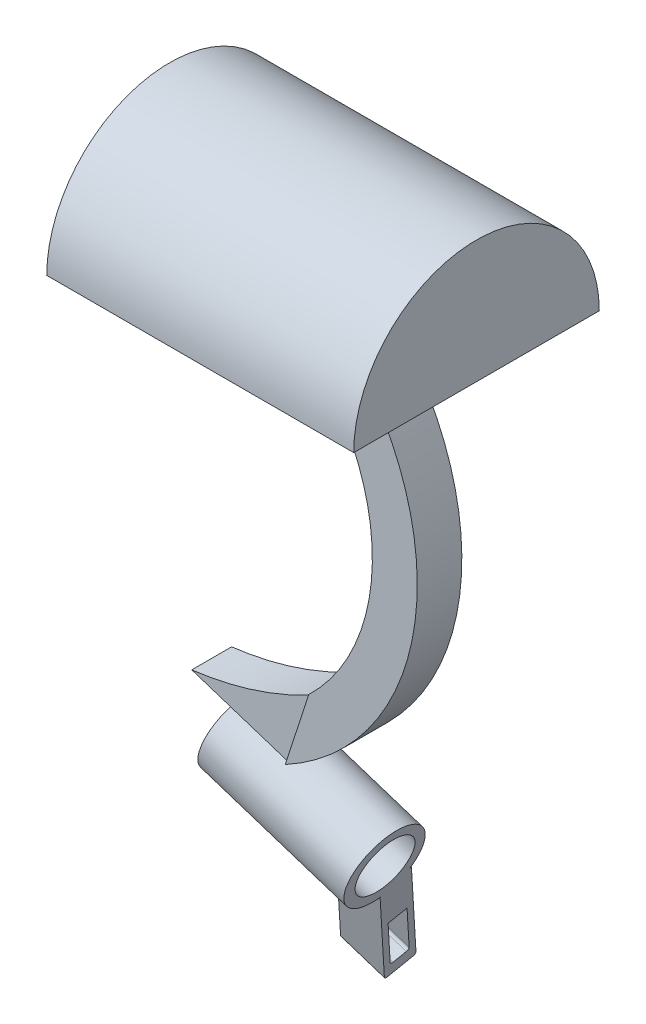
ISO-10303-21;
HEADER;
FILE_DESCRIPTION(('STEP AP214'),'2;1');
FILE_NAME('part.step','',(''),(''),'','','');
FILE_SCHEMA(('AUTOMOTIVE_DESIGN { 1 0 10303 214 1 1 1 1 }'));
ENDSEC;
DATA;
#1=APPLICATION_CONTEXT('core data for automotive mechanical design processes');
#2=APPLICATION_PROTOCOL_DEFINITION('international standard','automotive_design',2000,#1);
#3=PRODUCT_CONTEXT('',#1,'mechanical');
#4=PRODUCT('Part','Part','',(#3));
#5=PRODUCT_RELATED_PRODUCT_CATEGORY('part','',(#4));
#6=PRODUCT_DEFINITION_FORMATION('','',#4);
#7=PRODUCT_DEFINITION_CONTEXT('part definition',#1,'design');
#8=PRODUCT_DEFINITION('design','',#6,#7);
#9=PRODUCT_DEFINITION_SHAPE('','',#8);
#10=(LENGTH_UNIT() NAMED_UNIT(*) SI_UNIT(.MILLI.,.METRE.));
#11=(NAMED_UNIT(*) PLANE_ANGLE_UNIT() SI_UNIT($,.RADIAN.));
#12=(NAMED_UNIT(*) SI_UNIT($,.STERADIAN.) SOLID_ANGLE_UNIT());
#13=UNCERTAINTY_MEASURE_WITH_UNIT(LENGTH_MEASURE(1.E-05),#10,'distance_accuracy_value','');
#14=(GEOMETRIC_REPRESENTATION_CONTEXT(3) GLOBAL_UNCERTAINTY_ASSIGNED_CONTEXT((#13)) GLOBAL_UNIT_ASSIGNED_CONTEXT((#10,
#11,#12)) REPRESENTATION_CONTEXT('',''));
#15=CARTESIAN_POINT('',(0.,0.,0.));
#16=DIRECTION('',(0.,0.,1.));
#17=DIRECTION('',(1.,0.,0.));
#18=AXIS2_PLACEMENT_3D('',#15,#16,#17);
#19=CARTESIAN_POINT('',(8.4794198870601,-26.1055079561511,-2.00859754063387));
#20=DIRECTION('',(0.,0.,1.));
#21=DIRECTION('',(1.,0.,0.));
#22=AXIS2_PLACEMENT_3D('',#19,#20,#21);
#23=PLANE('',#22);
#24=CARTESIAN_POINT('',(3.49552899788866,-30.7707203906488,-2.00859754063387));
#25=CARTESIAN_POINT('',(8.6836530969002,-30.1293735054419,-2.00859754063387));
#26=CARTESIAN_POINT('',(13.3117496174866,-27.6723485276312,-2.00859754063387));
#27=B_SPLINE_CURVE_WITH_KNOTS('',2,(#24,#25,#26),.UNSPECIFIED.,.F.,.F.,(3,3),(0.,1.),.UNSPECIFIED.);
#28=CARTESIAN_POINT('',(13.3117496174866,-27.6723485276312,-2.00859754063387));
#29=VERTEX_POINT('',#28);
#30=CARTESIAN_POINT('',(3.49552899788866,-30.7707203906488,-2.00859754063387));
#31=VERTEX_POINT('',#30);
#32=EDGE_CURVE('E480',#29,#31,#27,.F.);
#33=ORIENTED_EDGE('',*,*,#32,.F.);
#34=DIRECTION('',(-0.308433183362237,-0.951246009926474,0.));
#35=VECTOR('',#34,1.);
#36=CARTESIAN_POINT('',(13.3117496174866,-27.6723485276312,-2.00859754063387));
#37=LINE('',#36,#35);
#38=CARTESIAN_POINT('',(11.4688730530924,-33.3560073335911,-2.00859754063387));
#39=VERTEX_POINT('',#38);
#40=EDGE_CURVE('E503',#29,#39,#37,.T.);
#41=ORIENTED_EDGE('',*,*,#40,.T.);
#42=DIRECTION('',(0.951246009926474,-0.308433183362237,0.));
#43=VECTOR('',#42,1.);
#44=CARTESIAN_POINT('',(6.63654332266587,-31.7891667621109,-2.00859754063387));
#45=LINE('',#44,#43);
#46=EDGE_CURVE('E423',#31,#39,#45,.T.);
#47=ORIENTED_EDGE('',*,*,#46,.F.);
#48=EDGE_LOOP('',(#33,#41,#47));
#49=FACE_BOUND('',#48,.T.);
#50=ADVANCED_FACE('F34',(#49),#23,.F.);
#51=CARTESIAN_POINT('',(8.4794198870601,-26.1055079561511,1.28638790770808));
#52=DIRECTION('',(0.,0.,-1.));
#53=DIRECTION('',(-1.,0.,0.));
#54=AXIS2_PLACEMENT_3D('',#51,#52,#53);
#55=PLANE('',#54);
#56=CARTESIAN_POINT('',(3.49552899788866,-30.7707203906488,1.28638790770808));
#57=CARTESIAN_POINT('',(8.6836530969002,-30.1293735054419,1.28638790770808));
#58=CARTESIAN_POINT('',(13.3117496174866,-27.6723485276312,1.28638790770808));
#59=B_SPLINE_CURVE_WITH_KNOTS('',2,(#56,#57,#58),.UNSPECIFIED.,.F.,.F.,(3,3),(0.,1.),.UNSPECIFIED.);
#60=CARTESIAN_POINT('',(3.49552899788866,-30.7707203906488,1.28638790770808));
#61=VERTEX_POINT('',#60);
#62=CARTESIAN_POINT('',(13.3117496174866,-27.6723485276312,1.28638790770808));
#63=VERTEX_POINT('',#62);
#64=EDGE_CURVE('E323',#61,#63,#59,.T.);
#65=ORIENTED_EDGE('',*,*,#64,.F.);
#66=DIRECTION('',(0.951246009926474,-0.308433183362237,0.));
#67=VECTOR('',#66,1.);
#68=CARTESIAN_POINT('',(6.63654332266587,-31.7891667621109,1.28638790770808));
#69=LINE('',#68,#67);
#70=CARTESIAN_POINT('',(11.4688730530924,-33.3560073335911,1.28638790770808));
#71=VERTEX_POINT('',#70);
#72=EDGE_CURVE('E414',#61,#71,#69,.T.);
#73=ORIENTED_EDGE('',*,*,#72,.T.);
#74=DIRECTION('',(0.308433183362237,0.951246009926474,0.));
#75=VECTOR('',#74,1.);
#76=CARTESIAN_POINT('',(13.3117496174866,-27.6723485276312,1.28638790770808));
#77=LINE('',#76,#75);
#78=EDGE_CURVE('E428',#71,#63,#77,.T.);
#79=ORIENTED_EDGE('',*,*,#78,.T.);
#80=EDGE_LOOP('',(#65,#73,#79));
#81=FACE_BOUND('',#80,.T.);
#82=ADVANCED_FACE('F398',(#81),#55,.F.);
#83=CARTESIAN_POINT('',(15.3320112562343,-4.97127030206573,0.));
#84=DIRECTION('',(0.951246009926474,-0.308433183362237,0.));
#85=DIRECTION('',(0.308433183362237,0.951246009926474,0.));
#86=AXIS2_PLACEMENT_3D('',#83,#84,#85);
#87=PLANE('',#86);
#88=CARTESIAN_POINT('',(5.73148782399525,-34.5804696384339,-0.391699089779879));
#89=DIRECTION('',(0.951246009926474,-0.308433183362237,0.));
#90=DIRECTION('',(0.308433183362237,0.951246009926474,0.));
#91=AXIS2_PLACEMENT_3D('',#88,#89,#90);
#92=CIRCLE('',#91,2.375);
#93=CARTESIAN_POINT('',(6.46401663448056,-32.3212603648585,-0.391699089779879));
#94=VERTEX_POINT('',#93);
#95=EDGE_CURVE('E235',#94,#94,#92,.T.);
#96=ORIENTED_EDGE('',*,*,#95,.T.);
#97=EDGE_LOOP('',(#96));
#98=FACE_BOUND('',#97,.T.);
#99=DIRECTION('',(0.,0.,1.));
#100=VECTOR('',#99,1.);
#101=CARTESIAN_POINT('',(6.63654332266588,-31.789166762111,1.28638790770808));
#102=LINE('',#101,#100);
#103=CARTESIAN_POINT('',(6.63654332266588,-31.7891667621109,-1.60844734182558));
#104=VERTEX_POINT('',#103);
#105=CARTESIAN_POINT('',(6.63654332266588,-31.7891667621109,0.88623770889979));
#106=VERTEX_POINT('',#105);
#107=EDGE_CURVE('E42',#104,#106,#102,.T.);
#108=ORIENTED_EDGE('',*,*,#107,.F.);
#109=CARTESIAN_POINT('',(5.72093113748741,-34.6130277627224,-0.361104816462897));
#110=DIRECTION('',(-0.951246009926474,0.308433183362237,0.));
#111=DIRECTION('',(-0.308433183362237,-0.951246009926474,0.));
#112=AXIS2_PLACEMENT_3D('',#109,#110,#111);
#113=CIRCLE('',#112,3.22000000000001);
#114=EDGE_CURVE('E483',#104,#106,#113,.T.);
#115=ORIENTED_EDGE('',*,*,#114,.T.);
#116=EDGE_LOOP('',(#108,#115));
#117=FACE_BOUND('',#116,.T.);
#118=ADVANCED_FACE('F347',(#98,#117),#87,.F.);
#119=CARTESIAN_POINT('',(16.3097017874055,-18.4262939737782,0.));
#120=DIRECTION('',(0.951246009926474,-0.308433183362237,0.));
#121=DIRECTION('',(0.,0.,1.));
#122=AXIS2_PLACEMENT_3D('',#119,#120,#121);
#123=PLANE('',#122);
#124=ORIENTED_EDGE('',*,*,#40,.F.);
#125=DIRECTION('',(0.,0.,-1.));
#126=VECTOR('',#125,1.);
#127=CARTESIAN_POINT('',(13.3117496174866,-27.6723485276312,1.28638790770808));
#128=LINE('',#127,#126);
#129=EDGE_CURVE('E424',#63,#29,#128,.T.);
#130=ORIENTED_EDGE('',*,*,#129,.F.);
#131=ORIENTED_EDGE('',*,*,#78,.F.);
#132=DIRECTION('',(0.,0.,1.));
#133=VECTOR('',#132,1.);
#134=CARTESIAN_POINT('',(11.4688730530924,-33.3560073335911,1.28638790770808));
#135=LINE('',#134,#133);
#136=CARTESIAN_POINT('',(11.4688730530924,-33.3560073335911,0.88623770889979));
#137=VERTEX_POINT('',#136);
#138=EDGE_CURVE('E419',#137,#71,#135,.T.);
#139=ORIENTED_EDGE('',*,*,#138,.F.);
#140=CARTESIAN_POINT('',(10.5532608679139,-36.1798683342026,-0.361104816462897));
#141=DIRECTION('',(0.951246009926474,-0.308433183362237,0.));
#142=DIRECTION('',(0.308433183362237,0.951246009926474,0.));
#143=AXIS2_PLACEMENT_3D('',#140,#141,#142);
#144=CIRCLE('',#143,3.22000000000001);
#145=CARTESIAN_POINT('',(11.4225779785249,-33.4987870581379,1.19597287984337));
#146=VERTEX_POINT('',#145);
#147=EDGE_CURVE('E360',#137,#146,#144,.T.);
#148=ORIENTED_EDGE('',*,*,#147,.T.);
#149=DIRECTION('',(0.,0.,-1.));
#150=VECTOR('',#149,1.);
#151=CARTESIAN_POINT('',(11.4225779785249,-33.4987870581379,-2.21601123595506));
#152=LINE('',#151,#150);
#153=CARTESIAN_POINT('',(11.4225779785249,-33.4987870581379,1.47398876404494));
#154=VERTEX_POINT('',#153);
#155=EDGE_CURVE('E452',#154,#146,#152,.T.);
#156=ORIENTED_EDGE('',*,*,#155,.F.);
#157=DIRECTION('',(-0.308433183362237,-0.951246009926473,0.));
#158=VECTOR('',#157,1.);
#159=CARTESIAN_POINT('',(13.3626227388853,-27.5154495415509,1.47398876404494));
#160=LINE('',#159,#158);
#161=CARTESIAN_POINT('',(13.3626227388853,-27.5154495415509,1.47398876404494));
#162=VERTEX_POINT('',#161);
#163=EDGE_CURVE('E440',#162,#154,#160,.T.);
#164=ORIENTED_EDGE('',*,*,#163,.F.);
#165=DIRECTION('',(0.,0.,1.));
#166=VECTOR('',#165,1.);
#167=CARTESIAN_POINT('',(13.3626227388853,-27.5154495415509,-2.21601123595506));
#168=LINE('',#167,#166);
#169=CARTESIAN_POINT('',(13.3626227388853,-27.5154495415509,-2.21601123595506));
#170=VERTEX_POINT('',#169);
#171=EDGE_CURVE('E434',#170,#162,#168,.T.);
#172=ORIENTED_EDGE('',*,*,#171,.F.);
#173=DIRECTION('',(0.308433183362237,0.951246009926473,0.));
#174=VECTOR('',#173,1.);
#175=CARTESIAN_POINT('',(13.3626227388853,-27.5154495415509,-2.21601123595506));
#176=LINE('',#175,#174);
#177=CARTESIAN_POINT('',(11.4225779785249,-33.4987870581379,-2.21601123595506));
#178=VERTEX_POINT('',#177);
#179=EDGE_CURVE('E458',#178,#170,#176,.T.);
#180=ORIENTED_EDGE('',*,*,#179,.F.);
#181=CARTESIAN_POINT('',(11.4225779785249,-33.4987870581379,-1.91818251276916));
#182=VERTEX_POINT('',#181);
#183=EDGE_CURVE('E450',#182,#178,#152,.T.);
#184=ORIENTED_EDGE('',*,*,#183,.F.);
#185=CARTESIAN_POINT('',(11.4688730530924,-33.3560073335911,-1.60844734182558));
#186=VERTEX_POINT('',#185);
#187=EDGE_CURVE('E359',#182,#186,#144,.T.);
#188=ORIENTED_EDGE('',*,*,#187,.T.);
#189=EDGE_CURVE('E506',#39,#186,#135,.T.);
#190=ORIENTED_EDGE('',*,*,#189,.F.);
#191=EDGE_LOOP('',(#124,#130,#131,#139,#148,#156,#164,#172,#180,#184,#188,#190));
#192=FACE_BOUND('',#191,.T.);
#193=ADVANCED_FACE('F377',(#192),#123,.F.);
#194=CARTESIAN_POINT('',(0.,0.,-0.742022471910108));
#195=DIRECTION('',(0.,1.,0.));
#196=DIRECTION('',(0.,0.,1.));
#197=AXIS2_PLACEMENT_3D('',#194,#195,#196);
#198=PLANE('',#197);
#199=DIRECTION('',(0.,0.,-1.));
#200=VECTOR('',#199,1.);
#201=CARTESIAN_POINT('',(0.,0.,-0.371011235955054));
#202=LINE('',#201,#200);
#203=CARTESIAN_POINT('',(0.,0.,9.78898876404495));
#204=VERTEX_POINT('',#203);
#205=CARTESIAN_POINT('',(0.,0.,-10.5310112359551));
#206=VERTEX_POINT('',#205);
#207=EDGE_CURVE('E464',#204,#206,#202,.T.);
#208=ORIENTED_EDGE('',*,*,#207,.T.);
#209=DIRECTION('',(-1.,0.,0.));
#210=VECTOR('',#209,1.);
#211=CARTESIAN_POINT('',(0.,0.,-10.5310112359551));
#212=LINE('',#211,#210);
#213=CARTESIAN_POINT('',(25.4,0.,-10.5310112359551));
#214=VERTEX_POINT('',#213);
#215=EDGE_CURVE('E461',#214,#206,#212,.T.);
#216=ORIENTED_EDGE('',*,*,#215,.F.);
#217=DIRECTION('',(0.,0.,1.));
#218=VECTOR('',#217,1.);
#219=CARTESIAN_POINT('',(25.4,0.,-0.371011235955054));
#220=LINE('',#219,#218);
#221=CARTESIAN_POINT('',(25.4,0.,9.78898876404495));
#222=VERTEX_POINT('',#221);
#223=EDGE_CURVE('E466',#214,#222,#220,.T.);
#224=ORIENTED_EDGE('',*,*,#223,.T.);
#225=DIRECTION('',(-1.,0.,0.));
#226=VECTOR('',#225,1.);
#227=CARTESIAN_POINT('',(0.,0.,9.78898876404495));
#228=LINE('',#227,#226);
#229=EDGE_CURVE('E469',#222,#204,#228,.T.);
#230=ORIENTED_EDGE('',*,*,#229,.T.);
#231=EDGE_LOOP('',(#208,#216,#224,#230));
#232=FACE_BOUND('',#231,.T.);
#233=DIRECTION('',(0.,0.,1.));
#234=VECTOR('',#233,1.);
#235=CARTESIAN_POINT('',(9.55499994,0.,-2.21601123595506));
#236=LINE('',#235,#234);
#237=CARTESIAN_POINT('',(9.55499994,0.,-2.21601123595506));
#238=VERTEX_POINT('',#237);
#239=CARTESIAN_POINT('',(9.55499994,0.,1.47398876404494));
#240=VERTEX_POINT('',#239);
#241=EDGE_CURVE('E426',#238,#240,#236,.T.);
#242=ORIENTED_EDGE('',*,*,#241,.T.);
#243=DIRECTION('',(1.,0.,0.));
#244=VECTOR('',#243,1.);
#245=CARTESIAN_POINT('',(9.55499994,0.,1.47398876404494));
#246=LINE('',#245,#244);
#247=CARTESIAN_POINT('',(15.84500006,0.,1.47398876404494));
#248=VERTEX_POINT('',#247);
#249=EDGE_CURVE('E433',#240,#248,#246,.T.);
#250=ORIENTED_EDGE('',*,*,#249,.T.);
#251=DIRECTION('',(0.,0.,-1.));
#252=VECTOR('',#251,1.);
#253=CARTESIAN_POINT('',(15.84500006,0.,-2.21601123595506));
#254=LINE('',#253,#252);
#255=CARTESIAN_POINT('',(15.84500006,0.,-2.21601123595506));
#256=VERTEX_POINT('',#255);
#257=EDGE_CURVE('E445',#248,#256,#254,.T.);
#258=ORIENTED_EDGE('',*,*,#257,.T.);
#259=DIRECTION('',(-1.,0.,0.));
#260=VECTOR('',#259,1.);
#261=CARTESIAN_POINT('',(9.55499994,0.,-2.21601123595506));
#262=LINE('',#261,#260);
#263=EDGE_CURVE('E443',#256,#238,#262,.T.);
#264=ORIENTED_EDGE('',*,*,#263,.T.);
#265=EDGE_LOOP('',(#242,#250,#258,#264));
#266=FACE_BOUND('',#265,.T.);
#267=ADVANCED_FACE('F380',(#232,#266),#198,.F.);
#268=CARTESIAN_POINT('',(0.,0.,-0.371011235955054));
#269=DIRECTION('',(1.,0.,0.));
#270=DIRECTION('',(0.,0.,-1.));
#271=AXIS2_PLACEMENT_3D('',#268,#269,#270);
#272=PLANE('',#271);
#273=CARTESIAN_POINT('',(0.,0.,-0.371011235955054));
#274=DIRECTION('',(-1.,0.,0.));
#275=DIRECTION('',(0.,0.,1.));
#276=AXIS2_PLACEMENT_3D('',#273,#274,#275);
#277=CIRCLE('',#276,10.16);
#278=EDGE_CURVE('E475',#204,#206,#277,.T.);
#279=ORIENTED_EDGE('',*,*,#278,.T.);
#280=ORIENTED_EDGE('',*,*,#207,.F.);
#281=EDGE_LOOP('',(#279,#280));
#282=FACE_BOUND('',#281,.T.);
#283=ADVANCED_FACE('F384',(#282),#272,.F.);
#284=CARTESIAN_POINT('',(0.,0.,-0.371011235955054));
#285=DIRECTION('',(-1.,0.,0.));
#286=DIRECTION('',(0.,0.,1.));
#287=AXIS2_PLACEMENT_3D('',#284,#285,#286);
#288=CYLINDRICAL_SURFACE('',#287,10.16);
#289=CARTESIAN_POINT('',(25.4,0.,-0.371011235955054));
#290=DIRECTION('',(-1.,0.,0.));
#291=DIRECTION('',(0.,0.,1.));
#292=AXIS2_PLACEMENT_3D('',#289,#290,#291);
#293=CIRCLE('',#292,10.16);
#294=EDGE_CURVE('E472',#222,#214,#293,.T.);
#295=ORIENTED_EDGE('',*,*,#294,.T.);
#296=ORIENTED_EDGE('',*,*,#215,.T.);
#297=ORIENTED_EDGE('',*,*,#278,.F.);
#298=ORIENTED_EDGE('',*,*,#229,.F.);
#299=EDGE_LOOP('',(#295,#296,#297,#298));
#300=FACE_BOUND('',#299,.T.);
#301=ADVANCED_FACE('F36',(#300),#288,.T.);
#302=CARTESIAN_POINT('',(25.4,0.,-0.371011235955054));
#303=DIRECTION('',(-1.,0.,0.));
#304=DIRECTION('',(0.,0.,1.));
#305=AXIS2_PLACEMENT_3D('',#302,#303,#304);
#306=PLANE('',#305);
#307=ORIENTED_EDGE('',*,*,#223,.F.);
#308=ORIENTED_EDGE('',*,*,#294,.F.);
#309=EDGE_LOOP('',(#307,#308));
#310=FACE_BOUND('',#309,.T.);
#311=ADVANCED_FACE('F376',(#310),#306,.F.);
#312=CARTESIAN_POINT('',(1.45678681096229,-15.1418176082245,0.));
#313=DIRECTION('',(0.,0.,-1.));
#314=DIRECTION('',(-1.,0.,0.));
#315=AXIS2_PLACEMENT_3D('',#312,#313,#314);
#316=CYLINDRICAL_SURFACE('',#315,17.1713626822118);
#317=CARTESIAN_POINT('',(1.45678681096229,-15.1418176082245,1.47398876404494));
#318=DIRECTION('',(0.,0.,-1.));
#319=DIRECTION('',(0.471611559251894,0.881806405726335,0.));
#320=AXIS2_PLACEMENT_3D('',#317,#318,#319);
#321=CIRCLE('',#320,17.1713626822118);
#322=EDGE_CURVE('E436',#240,#162,#321,.T.);
#323=ORIENTED_EDGE('',*,*,#322,.F.);
#324=ORIENTED_EDGE('',*,*,#241,.F.);
#325=CARTESIAN_POINT('',(1.45678681096229,-15.1418176082245,-2.21601123595506));
#326=DIRECTION('',(0.,0.,-1.));
#327=DIRECTION('',(0.471611559251894,0.881806405726335,0.));
#328=AXIS2_PLACEMENT_3D('',#325,#326,#327);
#329=CIRCLE('',#328,17.1713626822118);
#330=EDGE_CURVE('E437',#238,#170,#329,.T.);
#331=ORIENTED_EDGE('',*,*,#330,.T.);
#332=ORIENTED_EDGE('',*,*,#171,.T.);
#333=EDGE_LOOP('',(#323,#324,#331,#332));
#334=FACE_BOUND('',#333,.T.);
#335=ADVANCED_FACE('F389',(#334),#316,.F.);
#336=CARTESIAN_POINT('',(9.55499994,0.,1.47398876404494));
#337=DIRECTION('',(0.,0.,-1.));
#338=DIRECTION('',(-1.,0.,0.));
#339=AXIS2_PLACEMENT_3D('',#336,#337,#338);
#340=PLANE('',#339);
#341=CARTESIAN_POINT('',(1.45678681096229,-15.1418176082245,1.47398876404494));
#342=DIRECTION('',(0.,0.,-1.));
#343=DIRECTION('',(0.688837192778454,0.724916079174065,0.));
#344=AXIS2_PLACEMENT_3D('',#341,#342,#343);
#345=CIRCLE('',#344,20.8876834756878);
#346=EDGE_CURVE('E447',#248,#154,#345,.T.);
#347=ORIENTED_EDGE('',*,*,#346,.F.);
#348=ORIENTED_EDGE('',*,*,#249,.F.);
#349=ORIENTED_EDGE('',*,*,#322,.T.);
#350=ORIENTED_EDGE('',*,*,#163,.T.);
#351=EDGE_LOOP('',(#347,#348,#349,#350));
#352=FACE_BOUND('',#351,.T.);
#353=ADVANCED_FACE('F370',(#352),#340,.F.);
#354=CARTESIAN_POINT('',(1.45678681096229,-15.1418176082245,0.));
#355=DIRECTION('',(0.,0.,-1.));
#356=DIRECTION('',(-1.,0.,0.));
#357=AXIS2_PLACEMENT_3D('',#354,#355,#356);
#358=CYLINDRICAL_SURFACE('',#357,20.8876834756878);
#359=ORIENTED_EDGE('',*,*,#155,.T.);
#360=CARTESIAN_POINT('',(11.4225779785249,-33.4987870581379,1.19597287984337));
#361=CARTESIAN_POINT('',(11.4610881963903,-33.4778805321114,1.13848649285918));
#362=CARTESIAN_POINT('',(11.4976974271193,-33.457848595571,1.07938677636928));
#363=CARTESIAN_POINT('',(11.5667879864595,-33.4198030430014,0.958147248746149));
#364=CARTESIAN_POINT('',(11.5992665209433,-33.4017907941144,0.896005418774431));
#365=CARTESIAN_POINT('',(11.6598364071952,-33.3680160660679,0.768695207691123));
#366=CARTESIAN_POINT('',(11.6879099190608,-33.3522627564843,0.703515839204143));
#367=CARTESIAN_POINT('',(11.7391724176084,-33.3233666913531,0.570739597193408));
#368=CARTESIAN_POINT('',(11.7623624604645,-33.3102233713641,0.503143250109748));
#369=CARTESIAN_POINT('',(11.8243143230406,-33.2749918398734,0.29669962430612));
#370=CARTESIAN_POINT('',(11.8552549856085,-33.2572162665025,0.154619691802103));
#371=CARTESIAN_POINT('',(11.8943387194357,-33.2347267107852,-0.133235193575715));
#372=CARTESIAN_POINT('',(11.9025434014921,-33.2299774296705,-0.27899907833514));
#373=CARTESIAN_POINT('',(11.8960755868006,-33.2337098386662,-0.56115616866191));
#374=CARTESIAN_POINT('',(11.8827333700932,-33.2414221784818,-0.697591567284176));
#375=CARTESIAN_POINT('',(11.8363086598536,-33.2680845692179,-0.966191620227638));
#376=CARTESIAN_POINT('',(11.8031828968441,-33.2870592519493,-1.09834624196263));
#377=CARTESIAN_POINT('',(11.7200929138676,-33.3341799560083,-1.3508225921895));
#378=CARTESIAN_POINT('',(11.6706816916587,-33.36202388483,-1.47138397996124));
#379=CARTESIAN_POINT('',(11.5854696404533,-33.4094434209905,-1.64478194033506));
#380=CARTESIAN_POINT('',(11.5552716325635,-33.42616201534,-1.70125897601453));
#381=CARTESIAN_POINT('',(11.4914398477229,-33.4612714180094,-1.81165820209945));
#382=CARTESIAN_POINT('',(11.4578077810446,-33.4796613934306,-1.86558164487798));
#383=CARTESIAN_POINT('',(11.4225779785249,-33.4987870581379,-1.91818251276916));
#384=B_SPLINE_CURVE_WITH_KNOTS('',3,(#360,#361,#362,#363,#364,#365,#366,#367,#368,#369,#370,
#371,#372,#373,#374,#375,#376,#377,#378,#379,#380,#381,#382,#383),.UNSPECIFIED.,.F.,.F.,(4,2,2,
2,2,2,2,2,2,2,2,4),(0.,0.216825002257189,0.433795900112481,0.651624009827815,0.869404960189353,
1.30639403890528,1.74219778510535,2.15210832820271,2.56291870518645,2.96101197243392,
3.15944596650321,3.35778161163335),.UNSPECIFIED.);
#385=EDGE_CURVE('E350',#146,#182,#384,.T.);
#386=ORIENTED_EDGE('',*,*,#385,.T.);
#387=ORIENTED_EDGE('',*,*,#183,.T.);
#388=CARTESIAN_POINT('',(1.45678681096229,-15.1418176082245,-2.21601123595506));
#389=DIRECTION('',(0.,0.,-1.));
#390=DIRECTION('',(0.688837192778454,0.724916079174065,0.));
#391=AXIS2_PLACEMENT_3D('',#388,#389,#390);
#392=CIRCLE('',#391,20.8876834756878);
#393=EDGE_CURVE('E455',#256,#178,#392,.T.);
#394=ORIENTED_EDGE('',*,*,#393,.F.);
#395=ORIENTED_EDGE('',*,*,#257,.F.);
#396=ORIENTED_EDGE('',*,*,#346,.T.);
#397=EDGE_LOOP('',(#359,#386,#387,#394,#395,#396));
#398=FACE_BOUND('',#397,.T.);
#399=ADVANCED_FACE('F364',(#398),#358,.T.);
#400=CARTESIAN_POINT('',(9.55499994,0.,-2.21601123595506));
#401=DIRECTION('',(0.,0.,1.));
#402=DIRECTION('',(1.,0.,0.));
#403=AXIS2_PLACEMENT_3D('',#400,#401,#402);
#404=PLANE('',#403);
#405=ORIENTED_EDGE('',*,*,#179,.T.);
#406=ORIENTED_EDGE('',*,*,#330,.F.);
#407=ORIENTED_EDGE('',*,*,#263,.F.);
#408=ORIENTED_EDGE('',*,*,#393,.T.);
#409=EDGE_LOOP('',(#405,#406,#407,#408));
#410=FACE_BOUND('',#409,.T.);
#411=ADVANCED_FACE('F369',(#410),#404,.F.);
#412=CARTESIAN_POINT('',(6.63654332266587,-31.7891667621109,1.28638790770808));
#413=DIRECTION('',(0.308433183362237,0.951246009926474,0.));
#414=DIRECTION('',(-0.951246009926474,0.308433183362237,0.));
#415=AXIS2_PLACEMENT_3D('',#412,#413,#414);
#416=PLANE('',#415);
#417=ORIENTED_EDGE('',*,*,#72,.F.);
#418=DIRECTION('',(0.,0.,1.));
#419=VECTOR('',#418,1.);
#420=CARTESIAN_POINT('',(3.49552899788866,-30.7707203906488,1.28638790770808));
#421=LINE('',#420,#419);
#422=EDGE_CURVE('E416',#31,#61,#421,.T.);
#423=ORIENTED_EDGE('',*,*,#422,.F.);
#424=ORIENTED_EDGE('',*,*,#46,.T.);
#425=ORIENTED_EDGE('',*,*,#189,.T.);
#426=DIRECTION('',(-0.951246009926474,0.308433183362237,0.));
#427=VECTOR('',#426,1.);
#428=CARTESIAN_POINT('',(18.7173676487321,-35.7062681908114,-1.60844734182558));
#429=LINE('',#428,#427);
#430=EDGE_CURVE('E362',#186,#104,#429,.T.);
#431=ORIENTED_EDGE('',*,*,#430,.T.);
#432=ORIENTED_EDGE('',*,*,#107,.T.);
#433=DIRECTION('',(-0.951246009926474,0.308433183362237,0.));
#434=VECTOR('',#433,1.);
#435=CARTESIAN_POINT('',(18.7173676487321,-35.7062681908114,0.88623770889979));
#436=LINE('',#435,#434);
#437=EDGE_CURVE('E495',#106,#137,#436,.F.);
#438=ORIENTED_EDGE('',*,*,#437,.T.);
#439=ORIENTED_EDGE('',*,*,#138,.T.);
#440=EDGE_LOOP('',(#417,#423,#424,#425,#431,#432,#438,#439));
#441=FACE_BOUND('',#440,.T.);
#442=ADVANCED_FACE('F346',(#441),#416,.F.);
#443=CARTESIAN_POINT('',(17.8017554635536,-38.5301291914229,-0.361104816462897));
#444=DIRECTION('',(-0.951246009926474,0.308433183362237,0.));
#445=DIRECTION('',(-0.308433183362237,-0.951246009926474,0.));
#446=AXIS2_PLACEMENT_3D('',#443,#444,#445);
#447=CYLINDRICAL_SURFACE('',#446,3.22000000000001);
#448=DIRECTION('',(-0.951246009926474,0.308433183362237,0.));
#449=VECTOR('',#448,1.);
#450=CARTESIAN_POINT('',(17.239715303189,-40.2635304232138,-3.01587995341197));
#451=LINE('',#450,#449);
#452=CARTESIAN_POINT('',(13.6154680053691,-39.0883999946037,-3.01587995341197));
#453=VERTEX_POINT('',#452);
#454=CARTESIAN_POINT('',(17.239715303189,-40.2635304232138,-3.01587995341198));
#455=VERTEX_POINT('',#454);
#456=EDGE_CURVE('E52',#453,#455,#451,.F.);
#457=ORIENTED_EDGE('',*,*,#456,.F.);
#458=CARTESIAN_POINT('',(14.1775081657338,-37.3549987628127,-0.361104816462897));
#459=DIRECTION('',(0.951246009926474,-0.308433183362237,0.));
#460=DIRECTION('',(0.308433183362237,0.951246009926474,0.));
#461=AXIS2_PLACEMENT_3D('',#458,#459,#460);
#462=CIRCLE('',#461,3.22000000000001);
#463=CARTESIAN_POINT('',(13.2039055642628,-40.3577093655028,-0.996893311877438));
#464=VERTEX_POINT('',#463);
#465=EDGE_CURVE('E11',#453,#464,#462,.F.);
#466=ORIENTED_EDGE('',*,*,#465,.T.);
#467=DIRECTION('',(-0.951246009926474,0.308433183362237,0.));
#468=VECTOR('',#467,1.);
#469=CARTESIAN_POINT('',(16.8281528620827,-41.532839794113,-0.996893311877443));
#470=LINE('',#469,#468);
#471=CARTESIAN_POINT('',(16.8281528620827,-41.532839794113,-0.996893311877433));
#472=VERTEX_POINT('',#471);
#473=EDGE_CURVE('E305',#472,#464,#470,.T.);
#474=ORIENTED_EDGE('',*,*,#473,.F.);
#475=CARTESIAN_POINT('',(17.8017554635536,-38.5301291914229,-0.361104816462897));
#476=DIRECTION('',(-0.951246009926474,0.308433183362237,0.));
#477=DIRECTION('',(-0.308433183362237,-0.951246009926474,0.));
#478=AXIS2_PLACEMENT_3D('',#475,#476,#477);
#479=CIRCLE('',#478,3.22000000000001);
#480=EDGE_CURVE('E493',#472,#455,#479,.T.);
#481=ORIENTED_EDGE('',*,*,#480,.T.);
#482=EDGE_LOOP('',(#457,#466,#474,#481));
#483=FACE_BOUND('',#482,.T.);
#484=ORIENTED_EDGE('',*,*,#430,.F.);
#485=ORIENTED_EDGE('',*,*,#187,.F.);
#486=ORIENTED_EDGE('',*,*,#385,.F.);
#487=ORIENTED_EDGE('',*,*,#147,.F.);
#488=ORIENTED_EDGE('',*,*,#437,.F.);
#489=ORIENTED_EDGE('',*,*,#114,.F.);
#490=EDGE_LOOP('',(#484,#485,#486,#487,#488,#489));
#491=FACE_BOUND('',#490,.T.);
#492=ADVANCED_FACE('F341',(#483,#491),#447,.T.);
#493=CARTESIAN_POINT('',(17.8017554635536,-38.5301291914229,-0.361104816462897));
#494=DIRECTION('',(-0.951246009926474,0.308433183362237,0.));
#495=DIRECTION('',(-0.308433183362237,-0.951246009926474,0.));
#496=AXIS2_PLACEMENT_3D('',#493,#494,#495);
#497=PLANE('',#496);
#498=CARTESIAN_POINT('',(17.8123121500615,-38.4975710671343,-0.391699089779879));
#499=DIRECTION('',(-0.951246009926474,0.308433183362237,0.));
#500=DIRECTION('',(-0.308433183362237,-0.951246009926474,0.));
#501=AXIS2_PLACEMENT_3D('',#498,#499,#500);
#502=CIRCLE('',#501,2.375);
#503=CARTESIAN_POINT('',(17.0797833395761,-40.7567803407097,-0.391699089779879));
#504=VERTEX_POINT('',#503);
#505=EDGE_CURVE('E318',#504,#504,#502,.F.);
#506=ORIENTED_EDGE('',*,*,#505,.F.);
#507=EDGE_LOOP('',(#506));
#508=FACE_BOUND('',#507,.T.);
#509=ORIENTED_EDGE('',*,*,#480,.F.);
#510=DIRECTION('',(-0.170060779921615,-0.524488437275025,0.834260876643064));
#511=VECTOR('',#510,1.);
#512=CARTESIAN_POINT('',(17.2620144341909,-40.1947571506393,-3.12527197540911));
#513=LINE('',#512,#511);
#514=CARTESIAN_POINT('',(16.8232159879605,-41.5480657233046,-0.972674671136506));
#515=VERTEX_POINT('',#514);
#516=EDGE_CURVE('E291',#472,#515,#513,.T.);
#517=ORIENTED_EDGE('',*,*,#516,.T.);
#518=DIRECTION('',(-0.29139313716505,-0.898692404061698,-0.327783468916473));
#519=VECTOR('',#518,1.);
#520=CARTESIAN_POINT('',(16.8232159879605,-41.5480657233046,-0.972674671136506));
#521=LINE('',#520,#519);
#522=CARTESIAN_POINT('',(13.9915468247959,-50.2812829586522,-4.15797392065238));
#523=VERTEX_POINT('',#522);
#524=EDGE_CURVE('E295',#515,#523,#521,.T.);
#525=ORIENTED_EDGE('',*,*,#524,.T.);
#526=CARTESIAN_POINT('',(14.014658124495,-50.2100048575627,-4.37394442820214));
#527=DIRECTION('',(0.951246009926474,-0.308433183362237,0.));
#528=DIRECTION('',(0.308433183362237,0.951246009926474,0.));
#529=AXIS2_PLACEMENT_3D('',#526,#527,#528);
#530=CIRCLE('',#529,0.2286);
#531=CARTESIAN_POINT('',(13.9480456533391,-50.4154459411312,-4.44887572919645));
#532=VERTEX_POINT('',#531);
#533=EDGE_CURVE('E298',#523,#532,#530,.T.);
#534=ORIENTED_EDGE('',*,*,#533,.T.);
#535=DIRECTION('',(0.101099298771425,0.311802716926654,-0.944752876420645));
#536=VECTOR('',#535,1.);
#537=CARTESIAN_POINT('',(13.9480456533391,-50.4154459411312,-4.44887572919645));
#538=LINE('',#537,#536);
#539=CARTESIAN_POINT('',(14.1545713008694,-49.7784953509935,-6.37881690514854));
#540=VERTEX_POINT('',#539);
#541=EDGE_CURVE('E269',#532,#540,#538,.T.);
#542=ORIENTED_EDGE('',*,*,#541,.T.);
#543=CARTESIAN_POINT('',(14.2211837720253,-49.573054267425,-6.30388560415415));
#544=DIRECTION('',(0.951246009926474,-0.308433183362237,0.));
#545=DIRECTION('',(0.308433183362237,0.951246009926474,0.));
#546=AXIS2_PLACEMENT_3D('',#543,#544,#545);
#547=CIRCLE('',#546,0.22860000000005);
#548=CARTESIAN_POINT('',(14.2442950717244,-49.5017761663355,-6.51985611170399));
#549=VERTEX_POINT('',#548);
#550=EDGE_CURVE('E257',#540,#549,#547,.T.);
#551=ORIENTED_EDGE('',*,*,#550,.T.);
#552=DIRECTION('',(0.291393137165049,0.898692404061696,0.327783468916478));
#553=VECTOR('',#552,1.);
#554=CARTESIAN_POINT('',(14.2442950717244,-49.5017761663355,-6.51985611170399));
#555=LINE('',#554,#553);
#556=CARTESIAN_POINT('',(17.2620144341909,-40.1947571506393,-3.12527197540911));
#557=VERTEX_POINT('',#556);
#558=EDGE_CURVE('E288',#549,#557,#555,.T.);
#559=ORIENTED_EDGE('',*,*,#558,.T.);
#560=EDGE_CURVE('E292',#557,#455,#513,.T.);
#561=ORIENTED_EDGE('',*,*,#560,.T.);
#562=EDGE_LOOP('',(#509,#517,#525,#534,#542,#551,#559,#561));
#563=FACE_BOUND('',#562,.T.);
#564=DIRECTION('',(-0.101099298771427,-0.311802716926652,0.944752876420646));
#565=VECTOR('',#564,1.);
#566=CARTESIAN_POINT('',(15.7743911850211,-44.7827708806169,-2.68171980761193));
#567=LINE('',#566,#565);
#568=CARTESIAN_POINT('',(15.9260401331782,-44.3150668052269,-4.0988491222429));
#569=VERTEX_POINT('',#568);
#570=CARTESIAN_POINT('',(15.7743911850211,-44.7827708806169,-2.68171980761193));
#571=VERTEX_POINT('',#570);
#572=EDGE_CURVE('E211',#569,#571,#567,.T.);
#573=ORIENTED_EDGE('',*,*,#572,.F.);
#574=DIRECTION('',(0.29139313716504,0.898692404061669,0.32778346891656));
#575=VECTOR('',#574,1.);
#576=CARTESIAN_POINT('',(15.9260401331782,-44.3150668052269,-4.0988491222429));
#577=LINE('',#576,#575);
#578=CARTESIAN_POINT('',(14.5356869185091,-48.6030877419662,-5.66283516583119));
#579=VERTEX_POINT('',#578);
#580=EDGE_CURVE('E229',#579,#569,#577,.T.);
#581=ORIENTED_EDGE('',*,*,#580,.F.);
#582=CARTESIAN_POINT('',(14.5125756188098,-48.6743658430561,-5.44686465828153));
#583=DIRECTION('',(0.951246009926474,-0.308433183362237,0.));
#584=DIRECTION('',(-0.308433183362237,-0.951246009926474,0.));
#585=AXIS2_PLACEMENT_3D('',#582,#583,#584);
#586=CIRCLE('',#585,0.228600000000055);
#587=CARTESIAN_POINT('',(14.4459631476539,-48.8798069266246,-5.52179595927594));
#588=VERTEX_POINT('',#587);
#589=EDGE_CURVE('E232',#588,#579,#586,.T.);
#590=ORIENTED_EDGE('',*,*,#589,.F.);
#591=DIRECTION('',(0.101099298771423,0.311802716926652,-0.944752876420646));
#592=VECTOR('',#591,1.);
#593=CARTESIAN_POINT('',(14.4459631476539,-48.8798069266246,-5.52179595927594));
#594=LINE('',#593,#592);
#595=CARTESIAN_POINT('',(14.340536798895,-49.2049547998358,-4.53660765974449));
#596=VERTEX_POINT('',#595);
#597=EDGE_CURVE('E250',#596,#588,#594,.T.);
#598=ORIENTED_EDGE('',*,*,#597,.F.);
#599=CARTESIAN_POINT('',(14.4071492700509,-48.9995137162675,-4.46167635874966));
#600=DIRECTION('',(0.951246009926474,-0.308433183362237,0.));
#601=DIRECTION('',(0.308433183362237,0.951246009926474,0.));
#602=AXIS2_PLACEMENT_3D('',#599,#600,#601);
#603=CIRCLE('',#602,0.228599999999943);
#604=CARTESIAN_POINT('',(14.3840379703518,-49.0707918173569,-4.24570585119996));
#605=VERTEX_POINT('',#604);
#606=EDGE_CURVE('E247',#605,#596,#603,.T.);
#607=ORIENTED_EDGE('',*,*,#606,.F.);
#608=DIRECTION('',(-0.291393137165049,-0.898692404061698,-0.327783468916473));
#609=VECTOR('',#608,1.);
#610=CARTESIAN_POINT('',(14.3840379703518,-49.0707918173569,-4.24570585119999));
#611=LINE('',#610,#609);
#612=EDGE_CURVE('E245',#571,#605,#611,.T.);
#613=ORIENTED_EDGE('',*,*,#612,.F.);
#614=EDGE_LOOP('',(#573,#581,#590,#598,#607,#613));
#615=FACE_BOUND('',#614,.T.);
#616=ADVANCED_FACE('F336',(#508,#563,#615),#497,.F.);
#617=CARTESIAN_POINT('',(3.49552899788866,-30.7707203906488,3.302));
#618=CARTESIAN_POINT('',(8.6836530969002,-30.1293735054419,3.302));
#619=CARTESIAN_POINT('',(13.3117496174866,-27.6723485276312,3.302));
#620=B_SPLINE_CURVE_WITH_KNOTS('',2,(#617,#618,#619),.UNSPECIFIED.,.F.,.F.,(3,3),(0.,1.),.UNSPECIFIED.);
#621=DIRECTION('',(0.,0.,-1.));
#622=VECTOR('',#621,1.);
#623=SURFACE_OF_LINEAR_EXTRUSION('',#620,#622);
#624=ORIENTED_EDGE('',*,*,#32,.T.);
#625=ORIENTED_EDGE('',*,*,#422,.T.);
#626=ORIENTED_EDGE('',*,*,#64,.T.);
#627=ORIENTED_EDGE('',*,*,#129,.T.);
#628=EDGE_LOOP('',(#624,#625,#626,#627));
#629=FACE_BOUND('',#628,.T.);
#630=ADVANCED_FACE('F331',(#629),#623,.T.);
#631=CARTESIAN_POINT('',(20.2284770152747,-39.2809913528744,-0.391699089779879));
#632=DIRECTION('',(-0.951246009926474,0.308433183362237,0.));
#633=DIRECTION('',(-0.308433183362237,-0.951246009926474,0.));
#634=AXIS2_PLACEMENT_3D('',#631,#632,#633);
#635=CYLINDRICAL_SURFACE('',#634,2.375);
#636=ORIENTED_EDGE('',*,*,#505,.T.);
#637=EDGE_LOOP('',(#636));
#638=FACE_BOUND('',#637,.T.);
#639=ORIENTED_EDGE('',*,*,#95,.F.);
#640=EDGE_LOOP('',(#639));
#641=FACE_BOUND('',#640,.T.);
#642=ADVANCED_FACE('F335',(#638,#641),#635,.F.);
#643=CARTESIAN_POINT('',(13.637767136371,-39.0196267220291,-3.12527197540911));
#644=DIRECTION('',(0.257313737937591,0.793587330144477,0.551369920926728));
#645=DIRECTION('',(0.,-0.570582627371584,0.821240199540756));
#646=AXIS2_PLACEMENT_3D('',#643,#644,#645);
#647=PLANE('',#646);
#648=DIRECTION('',(-0.170060779921615,-0.524488437275025,0.834260876643064));
#649=VECTOR('',#648,1.);
#650=CARTESIAN_POINT('',(13.637767136371,-39.0196267220291,-3.12527197540911));
#651=LINE('',#650,#649);
#652=CARTESIAN_POINT('',(13.637767136371,-39.0196267220291,-3.12527197540911));
#653=VERTEX_POINT('',#652);
#654=EDGE_CURVE('E273',#653,#453,#651,.T.);
#655=ORIENTED_EDGE('',*,*,#654,.T.);
#656=ORIENTED_EDGE('',*,*,#456,.T.);
#657=ORIENTED_EDGE('',*,*,#560,.F.);
#658=DIRECTION('',(0.951246009926474,-0.308433183362237,0.));
#659=VECTOR('',#658,1.);
#660=CARTESIAN_POINT('',(13.637767136371,-39.0196267220291,-3.12527197540911));
#661=LINE('',#660,#659);
#662=EDGE_CURVE('E313',#653,#557,#661,.T.);
#663=ORIENTED_EDGE('',*,*,#662,.F.);
#664=EDGE_LOOP('',(#655,#656,#657,#663));
#665=FACE_BOUND('',#664,.T.);
#666=ADVANCED_FACE('F519',(#665),#647,.T.);
#667=CARTESIAN_POINT('',(10.5969364742054,-48.3979238388149,-6.30388560415415));
#668=DIRECTION('',(0.951246009926474,-0.308433183362237,0.));
#669=DIRECTION('',(0.308433183362237,0.951246009926474,0.));
#670=AXIS2_PLACEMENT_3D('',#667,#668,#669);
#671=CYLINDRICAL_SURFACE('',#670,0.22860000000005);
#672=ORIENTED_EDGE('',*,*,#550,.F.);
#673=DIRECTION('',(0.951246009926474,-0.308433183362237,0.));
#674=VECTOR('',#673,1.);
#675=CARTESIAN_POINT('',(10.5303240030495,-48.6033649223834,-6.37881690514854));
#676=LINE('',#675,#674);
#677=CARTESIAN_POINT('',(10.5303240030495,-48.6033649223834,-6.37881690514854));
#678=VERTEX_POINT('',#677);
#679=EDGE_CURVE('E303',#678,#540,#676,.T.);
#680=ORIENTED_EDGE('',*,*,#679,.F.);
#681=CARTESIAN_POINT('',(10.5969364742054,-48.3979238388149,-6.30388560415415));
#682=DIRECTION('',(0.951246009926474,-0.308433183362237,0.));
#683=DIRECTION('',(0.308433183362237,0.951246009926474,0.));
#684=AXIS2_PLACEMENT_3D('',#681,#682,#683);
#685=CIRCLE('',#684,0.22860000000005);
#686=CARTESIAN_POINT('',(10.6200477739046,-48.3266457377254,-6.51985611170399));
#687=VERTEX_POINT('',#686);
#688=EDGE_CURVE('E265',#678,#687,#685,.T.);
#689=ORIENTED_EDGE('',*,*,#688,.T.);
#690=DIRECTION('',(0.951246009926474,-0.308433183362237,0.));
#691=VECTOR('',#690,1.);
#692=CARTESIAN_POINT('',(10.6200477739046,-48.3266457377254,-6.51985611170399));
#693=LINE('',#692,#691);
#694=EDGE_CURVE('E285',#687,#549,#693,.T.);
#695=ORIENTED_EDGE('',*,*,#694,.T.);
#696=EDGE_LOOP('',(#672,#680,#689,#695));
#697=FACE_BOUND('',#696,.T.);
#698=ADVANCED_FACE('F523',(#697),#671,.T.);
#699=CARTESIAN_POINT('',(10.3237983555192,-49.2403155125211,-4.44887572919645));
#700=DIRECTION('',(-0.29139313716505,-0.898692404061698,-0.327783468916474));
#701=DIRECTION('',(0.,0.342653468975565,-0.939461867346947));
#702=AXIS2_PLACEMENT_3D('',#699,#700,#701);
#703=PLANE('',#702);
#704=ORIENTED_EDGE('',*,*,#541,.F.);
#705=DIRECTION('',(0.951246009926474,-0.308433183362237,0.));
#706=VECTOR('',#705,1.);
#707=CARTESIAN_POINT('',(10.3237983555192,-49.2403155125211,-4.44887572919645));
#708=LINE('',#707,#706);
#709=CARTESIAN_POINT('',(10.3237983555192,-49.2403155125211,-4.44887572919645));
#710=VERTEX_POINT('',#709);
#711=EDGE_CURVE('E306',#710,#532,#708,.T.);
#712=ORIENTED_EDGE('',*,*,#711,.F.);
#713=DIRECTION('',(0.101099298771425,0.311802716926654,-0.944752876420645));
#714=VECTOR('',#713,1.);
#715=CARTESIAN_POINT('',(10.3237983555192,-49.2403155125211,-4.44887572919645));
#716=LINE('',#715,#714);
#717=EDGE_CURVE('E282',#710,#678,#716,.T.);
#718=ORIENTED_EDGE('',*,*,#717,.T.);
#719=ORIENTED_EDGE('',*,*,#679,.T.);
#720=EDGE_LOOP('',(#704,#712,#718,#719));
#721=FACE_BOUND('',#720,.T.);
#722=ADVANCED_FACE('F530',(#721),#703,.T.);
#723=CARTESIAN_POINT('',(10.3904108266752,-49.0348744289526,-4.37394442820214));
#724=DIRECTION('',(0.951246009926474,-0.308433183362237,0.));
#725=DIRECTION('',(0.308433183362237,0.951246009926474,0.));
#726=AXIS2_PLACEMENT_3D('',#723,#724,#725);
#727=CYLINDRICAL_SURFACE('',#726,0.2286);
#728=ORIENTED_EDGE('',*,*,#533,.F.);
#729=DIRECTION('',(0.951246009926474,-0.308433183362237,0.));
#730=VECTOR('',#729,1.);
#731=CARTESIAN_POINT('',(10.367299526976,-49.106152530042,-4.15797392065238));
#732=LINE('',#731,#730);
#733=CARTESIAN_POINT('',(10.367299526976,-49.106152530042,-4.15797392065238));
#734=VERTEX_POINT('',#733);
#735=EDGE_CURVE('E308',#734,#523,#732,.T.);
#736=ORIENTED_EDGE('',*,*,#735,.F.);
#737=CARTESIAN_POINT('',(10.3904108266752,-49.0348744289526,-4.37394442820214));
#738=DIRECTION('',(0.951246009926474,-0.308433183362237,0.));
#739=DIRECTION('',(0.308433183362237,0.951246009926474,0.));
#740=AXIS2_PLACEMENT_3D('',#737,#738,#739);
#741=CIRCLE('',#740,0.2286);
#742=EDGE_CURVE('E279',#734,#710,#741,.T.);
#743=ORIENTED_EDGE('',*,*,#742,.T.);
#744=ORIENTED_EDGE('',*,*,#711,.T.);
#745=EDGE_LOOP('',(#728,#736,#743,#744));
#746=FACE_BOUND('',#745,.T.);
#747=ADVANCED_FACE('F543',(#746),#727,.T.);
#748=CARTESIAN_POINT('',(13.1989686901407,-40.3729352946945,-0.972674671136506));
#749=DIRECTION('',(-0.101099298771424,-0.311802716926653,0.944752876420646));
#750=DIRECTION('',(0.,-0.949618398272712,-0.313408515618146));
#751=AXIS2_PLACEMENT_3D('',#748,#749,#750);
#752=PLANE('',#751);
#753=ORIENTED_EDGE('',*,*,#524,.F.);
#754=DIRECTION('',(0.951246009926474,-0.308433183362237,0.));
#755=VECTOR('',#754,1.);
#756=CARTESIAN_POINT('',(13.1989686901407,-40.3729352946945,-0.972674671136506));
#757=LINE('',#756,#755);
#758=CARTESIAN_POINT('',(13.1989686901407,-40.3729352946945,-0.972674671136506));
#759=VERTEX_POINT('',#758);
#760=EDGE_CURVE('E310',#759,#515,#757,.T.);
#761=ORIENTED_EDGE('',*,*,#760,.F.);
#762=DIRECTION('',(-0.29139313716505,-0.898692404061698,-0.327783468916473));
#763=VECTOR('',#762,1.);
#764=CARTESIAN_POINT('',(13.1989686901407,-40.3729352946945,-0.972674671136506));
#765=LINE('',#764,#763);
#766=EDGE_CURVE('E276',#759,#734,#765,.T.);
#767=ORIENTED_EDGE('',*,*,#766,.T.);
#768=ORIENTED_EDGE('',*,*,#735,.T.);
#769=EDGE_LOOP('',(#753,#761,#767,#768));
#770=FACE_BOUND('',#769,.T.);
#771=ADVANCED_FACE('F536',(#770),#752,.T.);
#772=ORIENTED_EDGE('',*,*,#516,.F.);
#773=ORIENTED_EDGE('',*,*,#473,.T.);
#774=EDGE_CURVE('E272',#464,#759,#651,.T.);
#775=ORIENTED_EDGE('',*,*,#774,.T.);
#776=ORIENTED_EDGE('',*,*,#760,.T.);
#777=EDGE_LOOP('',(#772,#773,#775,#776));
#778=FACE_BOUND('',#777,.T.);
#779=ADVANCED_FACE('F526',(#778),#647,.T.);
#780=CARTESIAN_POINT('',(10.6200477739046,-48.3266457377254,-6.51985611170399));
#781=DIRECTION('',(0.101099298771426,0.311802716926658,-0.944752876420644));
#782=DIRECTION('',(0.,0.94961839827271,0.313408515618151));
#783=AXIS2_PLACEMENT_3D('',#780,#781,#782);
#784=PLANE('',#783);
#785=ORIENTED_EDGE('',*,*,#558,.F.);
#786=ORIENTED_EDGE('',*,*,#694,.F.);
#787=DIRECTION('',(0.291393137165049,0.898692404061696,0.327783468916478));
#788=VECTOR('',#787,1.);
#789=CARTESIAN_POINT('',(10.6200477739046,-48.3266457377254,-6.51985611170399));
#790=LINE('',#789,#788);
#791=EDGE_CURVE('E268',#687,#653,#790,.T.);
#792=ORIENTED_EDGE('',*,*,#791,.T.);
#793=ORIENTED_EDGE('',*,*,#662,.T.);
#794=EDGE_LOOP('',(#785,#786,#792,#793));
#795=FACE_BOUND('',#794,.T.);
#796=ADVANCED_FACE('F535',(#795),#784,.T.);
#797=CARTESIAN_POINT('',(10.5969364742054,-48.3979238388149,-6.30388560415415));
#798=DIRECTION('',(0.951246009926474,-0.308433183362237,0.));
#799=DIRECTION('',(0.308433183362237,0.951246009926474,0.));
#800=AXIS2_PLACEMENT_3D('',#797,#798,#799);
#801=PLANE('',#800);
#802=ORIENTED_EDGE('',*,*,#465,.F.);
#803=ORIENTED_EDGE('',*,*,#654,.F.);
#804=ORIENTED_EDGE('',*,*,#791,.F.);
#805=ORIENTED_EDGE('',*,*,#688,.F.);
#806=ORIENTED_EDGE('',*,*,#717,.F.);
#807=ORIENTED_EDGE('',*,*,#742,.F.);
#808=ORIENTED_EDGE('',*,*,#766,.F.);
#809=ORIENTED_EDGE('',*,*,#774,.F.);
#810=EDGE_LOOP('',(#802,#803,#804,#805,#806,#807,#808,#809));
#811=FACE_BOUND('',#810,.T.);
#812=DIRECTION('',(0.29139313716504,0.898692404061669,0.32778346891656));
#813=VECTOR('',#812,1.);
#814=CARTESIAN_POINT('',(12.3017928353583,-43.1399363766168,-4.0988491222429));
#815=LINE('',#814,#813);
#816=CARTESIAN_POINT('',(10.9114396206892,-47.4279573133561,-5.66283516583119));
#817=VERTEX_POINT('',#816);
#818=CARTESIAN_POINT('',(12.3017928353583,-43.1399363766168,-4.0988491222429));
#819=VERTEX_POINT('',#818);
#820=EDGE_CURVE('E216',#817,#819,#815,.T.);
#821=ORIENTED_EDGE('',*,*,#820,.T.);
#822=DIRECTION('',(-0.101099298771427,-0.311802716926652,0.944752876420646));
#823=VECTOR('',#822,1.);
#824=CARTESIAN_POINT('',(12.1501438872012,-43.6076404520068,-2.68171980761193));
#825=LINE('',#824,#823);
#826=CARTESIAN_POINT('',(12.1501438872012,-43.6076404520068,-2.68171980761193));
#827=VERTEX_POINT('',#826);
#828=EDGE_CURVE('E208',#819,#827,#825,.T.);
#829=ORIENTED_EDGE('',*,*,#828,.T.);
#830=DIRECTION('',(-0.291393137165049,-0.898692404061698,-0.327783468916473));
#831=VECTOR('',#830,1.);
#832=CARTESIAN_POINT('',(10.7597906725319,-47.8956613887468,-4.24570585119999));
#833=LINE('',#832,#831);
#834=CARTESIAN_POINT('',(10.7597906725319,-47.8956613887467,-4.24570585119996));
#835=VERTEX_POINT('',#834);
#836=EDGE_CURVE('E220',#827,#835,#833,.T.);
#837=ORIENTED_EDGE('',*,*,#836,.T.);
#838=CARTESIAN_POINT('',(10.782901972231,-47.8243832876573,-4.46167635874966));
#839=DIRECTION('',(0.951246009926474,-0.308433183362237,0.));
#840=DIRECTION('',(0.308433183362237,0.951246009926474,0.));
#841=AXIS2_PLACEMENT_3D('',#838,#839,#840);
#842=CIRCLE('',#841,0.228599999999943);
#843=CARTESIAN_POINT('',(10.7162895010752,-48.0298243712256,-4.53660765974449));
#844=VERTEX_POINT('',#843);
#845=EDGE_CURVE('E224',#835,#844,#842,.T.);
#846=ORIENTED_EDGE('',*,*,#845,.T.);
#847=DIRECTION('',(0.101099298771423,0.311802716926652,-0.944752876420646));
#848=VECTOR('',#847,1.);
#849=CARTESIAN_POINT('',(10.821715849834,-47.7046764980145,-5.52179595927594));
#850=LINE('',#849,#848);
#851=CARTESIAN_POINT('',(10.821715849834,-47.7046764980145,-5.52179595927594));
#852=VERTEX_POINT('',#851);
#853=EDGE_CURVE('E238',#844,#852,#850,.T.);
#854=ORIENTED_EDGE('',*,*,#853,.T.);
#855=CARTESIAN_POINT('',(10.88832832099,-47.499235414446,-5.44686465828153));
#856=DIRECTION('',(0.951246009926474,-0.308433183362237,0.));
#857=DIRECTION('',(-0.308433183362237,-0.951246009926474,0.));
#858=AXIS2_PLACEMENT_3D('',#855,#856,#857);
#859=CIRCLE('',#858,0.228600000000055);
#860=EDGE_CURVE('E241',#852,#817,#859,.T.);
#861=ORIENTED_EDGE('',*,*,#860,.T.);
#862=EDGE_LOOP('',(#821,#829,#837,#846,#854,#861));
#863=FACE_BOUND('',#862,.T.);
#864=ADVANCED_FACE('F226',(#811,#863),#801,.F.);
#865=CARTESIAN_POINT('',(12.1501438872012,-43.6076404520068,-2.68171980761193));
#866=DIRECTION('',(0.29139313716505,0.898692404061698,0.327783468916473));
#867=DIRECTION('',(0.,-0.342653468975563,0.939461867346947));
#868=AXIS2_PLACEMENT_3D('',#865,#866,#867);
#869=PLANE('',#868);
#870=ORIENTED_EDGE('',*,*,#572,.T.);
#871=DIRECTION('',(0.951246009926474,-0.308433183362237,0.));
#872=VECTOR('',#871,1.);
#873=CARTESIAN_POINT('',(12.1501438872012,-43.6076404520068,-2.68171980761193));
#874=LINE('',#873,#872);
#875=EDGE_CURVE('E204',#827,#571,#874,.T.);
#876=ORIENTED_EDGE('',*,*,#875,.F.);
#877=ORIENTED_EDGE('',*,*,#828,.F.);
#878=DIRECTION('',(0.951246009926474,-0.308433183362237,0.));
#879=VECTOR('',#878,1.);
#880=CARTESIAN_POINT('',(12.3017928353583,-43.1399363766168,-4.0988491222429));
#881=LINE('',#880,#879);
#882=EDGE_CURVE('E255',#819,#569,#881,.T.);
#883=ORIENTED_EDGE('',*,*,#882,.T.);
#884=EDGE_LOOP('',(#870,#876,#877,#883));
#885=FACE_BOUND('',#884,.T.);
#886=ADVANCED_FACE('F206',(#885),#869,.F.);
#887=CARTESIAN_POINT('',(12.3017928353583,-43.1399363766168,-4.0988491222429));
#888=DIRECTION('',(0.101099298771451,0.311802716926736,-0.944752876420615));
#889=DIRECTION('',(0.,0.949618398272684,0.31340851561823));
#890=AXIS2_PLACEMENT_3D('',#887,#888,#889);
#891=PLANE('',#890);
#892=ORIENTED_EDGE('',*,*,#580,.T.);
#893=ORIENTED_EDGE('',*,*,#882,.F.);
#894=ORIENTED_EDGE('',*,*,#820,.F.);
#895=DIRECTION('',(0.951246009926474,-0.308433183362237,0.));
#896=VECTOR('',#895,1.);
#897=CARTESIAN_POINT('',(10.9114396206892,-47.4279573133561,-5.66283516583119));
#898=LINE('',#897,#896);
#899=EDGE_CURVE('E258',#817,#579,#898,.T.);
#900=ORIENTED_EDGE('',*,*,#899,.T.);
#901=EDGE_LOOP('',(#892,#893,#894,#900));
#902=FACE_BOUND('',#901,.T.);
#903=ADVANCED_FACE('F576',(#902),#891,.F.);
#904=CARTESIAN_POINT('',(10.88832832099,-47.499235414446,-5.44686465828153));
#905=DIRECTION('',(0.951246009926474,-0.308433183362237,0.));
#906=DIRECTION('',(0.308433183362237,0.951246009926474,0.));
#907=AXIS2_PLACEMENT_3D('',#904,#905,#906);
#908=CYLINDRICAL_SURFACE('',#907,0.228600000000055);
#909=ORIENTED_EDGE('',*,*,#589,.T.);
#910=ORIENTED_EDGE('',*,*,#899,.F.);
#911=ORIENTED_EDGE('',*,*,#860,.F.);
#912=DIRECTION('',(0.951246009926474,-0.308433183362237,0.));
#913=VECTOR('',#912,1.);
#914=CARTESIAN_POINT('',(10.821715849834,-47.7046764980145,-5.52179595927594));
#915=LINE('',#914,#913);
#916=EDGE_CURVE('E260',#852,#588,#915,.T.);
#917=ORIENTED_EDGE('',*,*,#916,.T.);
#918=EDGE_LOOP('',(#909,#910,#911,#917));
#919=FACE_BOUND('',#918,.T.);
#920=ADVANCED_FACE('F586',(#919),#908,.F.);
#921=CARTESIAN_POINT('',(10.821715849834,-47.7046764980145,-5.52179595927594));
#922=DIRECTION('',(-0.29139313716505,-0.898692404061698,-0.327783468916472));
#923=DIRECTION('',(0.,0.342653468975562,-0.939461867346947));
#924=AXIS2_PLACEMENT_3D('',#921,#922,#923);
#925=PLANE('',#924);
#926=ORIENTED_EDGE('',*,*,#597,.T.);
#927=ORIENTED_EDGE('',*,*,#916,.F.);
#928=ORIENTED_EDGE('',*,*,#853,.F.);
#929=DIRECTION('',(0.951246009926474,-0.308433183362237,0.));
#930=VECTOR('',#929,1.);
#931=CARTESIAN_POINT('',(10.7162895010752,-48.0298243712256,-4.53660765974449));
#932=LINE('',#931,#930);
#933=EDGE_CURVE('E262',#844,#596,#932,.T.);
#934=ORIENTED_EDGE('',*,*,#933,.T.);
#935=EDGE_LOOP('',(#926,#927,#928,#934));
#936=FACE_BOUND('',#935,.T.);
#937=ADVANCED_FACE('F582',(#936),#925,.F.);
#938=CARTESIAN_POINT('',(10.782901972231,-47.8243832876573,-4.46167635874966));
#939=DIRECTION('',(0.951246009926474,-0.308433183362237,0.));
#940=DIRECTION('',(0.308433183362237,0.951246009926474,0.));
#941=AXIS2_PLACEMENT_3D('',#938,#939,#940);
#942=CYLINDRICAL_SURFACE('',#941,0.228599999999943);
#943=ORIENTED_EDGE('',*,*,#606,.T.);
#944=ORIENTED_EDGE('',*,*,#933,.F.);
#945=ORIENTED_EDGE('',*,*,#845,.F.);
#946=DIRECTION('',(0.951246009926474,-0.308433183362237,0.));
#947=VECTOR('',#946,1.);
#948=CARTESIAN_POINT('',(10.7597906725319,-47.8956613887468,-4.24570585119996));
#949=LINE('',#948,#947);
#950=EDGE_CURVE('E215',#835,#605,#949,.T.);
#951=ORIENTED_EDGE('',*,*,#950,.T.);
#952=EDGE_LOOP('',(#943,#944,#945,#951));
#953=FACE_BOUND('',#952,.T.);
#954=ADVANCED_FACE('F579',(#953),#942,.F.);
#955=CARTESIAN_POINT('',(10.7597906725319,-47.8956613887468,-4.24570585119999));
#956=DIRECTION('',(-0.101099298771425,-0.311802716926653,0.944752876420646));
#957=DIRECTION('',(0.,-0.949618398272712,-0.313408515618146));
#958=AXIS2_PLACEMENT_3D('',#955,#956,#957);
#959=PLANE('',#958);
#960=ORIENTED_EDGE('',*,*,#612,.T.);
#961=ORIENTED_EDGE('',*,*,#950,.F.);
#962=ORIENTED_EDGE('',*,*,#836,.F.);
#963=ORIENTED_EDGE('',*,*,#875,.T.);
#964=EDGE_LOOP('',(#960,#961,#962,#963));
#965=FACE_BOUND('',#964,.T.);
#966=ADVANCED_FACE('F221',(#965),#959,.F.);
#967=CLOSED_SHELL('',(#50,#82,#118,#193,#267,#283,#301,#311,#335,#353,#399,#411,#442,#492,#616,
#630,#642,#666,#698,#722,#747,#771,#779,#796,#864,#886,#903,#920,#937,#954,#966));
#968=MANIFOLD_SOLID_BREP('B2',#967);
#969=ADVANCED_BREP_SHAPE_REPRESENTATION('',(#18,#968),#14);
#970=SHAPE_DEFINITION_REPRESENTATION(#9,#969);
ENDSEC;
END-ISO-10303-21;
